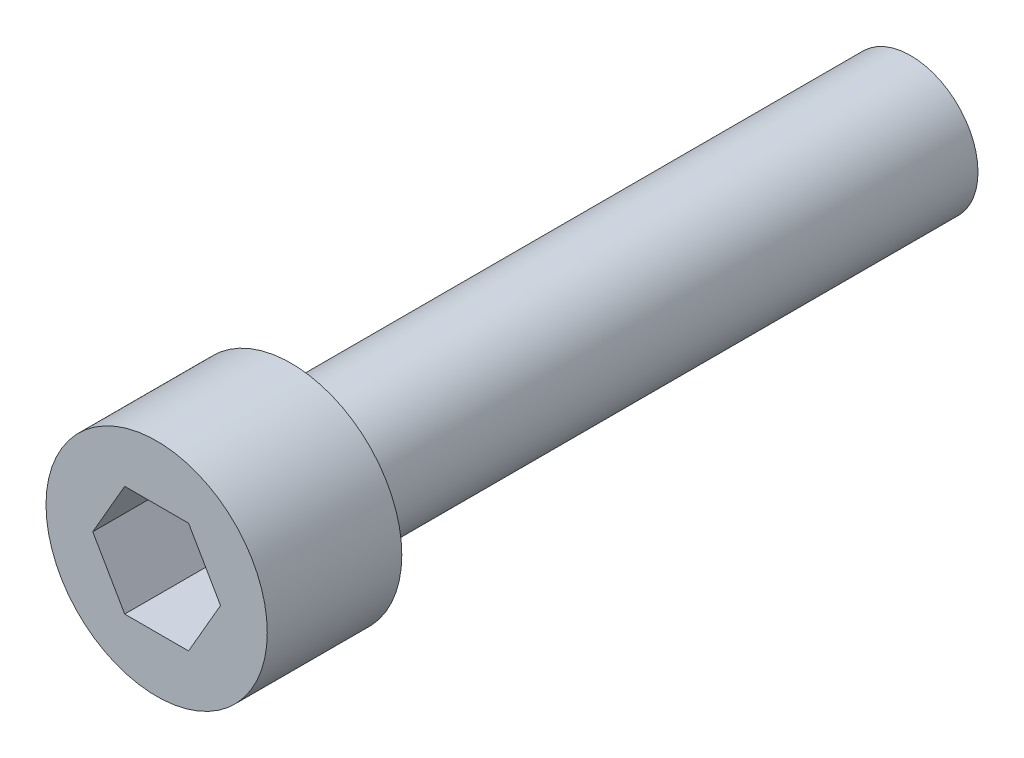
ISO-10303-21;
HEADER;
FILE_DESCRIPTION(('STEP AP214'),'2;1');
FILE_NAME('part.step','',(''),(''),'','','');
FILE_SCHEMA(('AUTOMOTIVE_DESIGN { 1 0 10303 214 1 1 1 1 }'));
ENDSEC;
DATA;
#1=APPLICATION_CONTEXT('core data for automotive mechanical design processes');
#2=APPLICATION_PROTOCOL_DEFINITION('international standard','automotive_design',2000,#1);
#3=PRODUCT_CONTEXT('',#1,'mechanical');
#4=PRODUCT('Part','Part','',(#3));
#5=PRODUCT_RELATED_PRODUCT_CATEGORY('part','',(#4));
#6=PRODUCT_DEFINITION_FORMATION('','',#4);
#7=PRODUCT_DEFINITION_CONTEXT('part definition',#1,'design');
#8=PRODUCT_DEFINITION('design','',#6,#7);
#9=PRODUCT_DEFINITION_SHAPE('','',#8);
#10=(LENGTH_UNIT() NAMED_UNIT(*) SI_UNIT(.MILLI.,.METRE.));
#11=(NAMED_UNIT(*) PLANE_ANGLE_UNIT() SI_UNIT($,.RADIAN.));
#12=(NAMED_UNIT(*) SI_UNIT($,.STERADIAN.) SOLID_ANGLE_UNIT());
#13=UNCERTAINTY_MEASURE_WITH_UNIT(LENGTH_MEASURE(1.E-05),#10,'distance_accuracy_value','');
#14=(GEOMETRIC_REPRESENTATION_CONTEXT(3) GLOBAL_UNCERTAINTY_ASSIGNED_CONTEXT((#13)) GLOBAL_UNIT_ASSIGNED_CONTEXT((#10,
#11,#12)) REPRESENTATION_CONTEXT('',''));
#15=CARTESIAN_POINT('',(0.,0.,0.));
#16=DIRECTION('',(0.,0.,1.));
#17=DIRECTION('',(1.,0.,0.));
#18=AXIS2_PLACEMENT_3D('',#15,#16,#17);
#19=CARTESIAN_POINT('',(0.,0.,22.225));
#20=DIRECTION('',(0.,0.,-1.));
#21=DIRECTION('',(-1.,0.,0.));
#22=AXIS2_PLACEMENT_3D('',#19,#20,#21);
#23=CYLINDRICAL_SURFACE('',#22,2.413);
#24=CARTESIAN_POINT('',(0.,0.,22.225));
#25=DIRECTION('',(0.,0.,1.));
#26=DIRECTION('',(1.,0.,0.));
#27=AXIS2_PLACEMENT_3D('',#24,#25,#26);
#28=CIRCLE('',#27,2.413);
#29=CARTESIAN_POINT('',(2.413,0.,22.225));
#30=VERTEX_POINT('',#29);
#31=EDGE_CURVE('E11',#30,#30,#28,.T.);
#32=ORIENTED_EDGE('',*,*,#31,.F.);
#33=EDGE_LOOP('',(#32));
#34=FACE_BOUND('',#33,.T.);
#35=CARTESIAN_POINT('',(0.,0.,0.));
#36=DIRECTION('',(0.,0.,1.));
#37=DIRECTION('',(1.,0.,0.));
#38=AXIS2_PLACEMENT_3D('',#35,#36,#37);
#39=CIRCLE('',#38,2.413);
#40=CARTESIAN_POINT('',(2.413,0.,0.));
#41=VERTEX_POINT('',#40);
#42=EDGE_CURVE('E36',#41,#41,#39,.T.);
#43=ORIENTED_EDGE('',*,*,#42,.T.);
#44=EDGE_LOOP('',(#43));
#45=FACE_BOUND('',#44,.T.);
#46=ADVANCED_FACE('F33',(#34,#45),#23,.T.);
#47=CARTESIAN_POINT('',(0.,0.,0.));
#48=DIRECTION('',(0.,0.,1.));
#49=DIRECTION('',(1.,0.,0.));
#50=AXIS2_PLACEMENT_3D('',#47,#48,#49);
#51=PLANE('',#50);
#52=ORIENTED_EDGE('',*,*,#42,.F.);
#53=EDGE_LOOP('',(#52));
#54=FACE_BOUND('',#53,.T.);
#55=ADVANCED_FACE('F151',(#54),#51,.F.);
#56=CARTESIAN_POINT('',(0.,0.,22.225));
#57=DIRECTION('',(0.,0.,1.));
#58=DIRECTION('',(1.,0.,0.));
#59=AXIS2_PLACEMENT_3D('',#56,#57,#58);
#60=PLANE('',#59);
#61=CARTESIAN_POINT('',(0.,0.,22.225));
#62=DIRECTION('',(0.,0.,1.));
#63=DIRECTION('',(1.,0.,0.));
#64=AXIS2_PLACEMENT_3D('',#61,#62,#63);
#65=CIRCLE('',#64,3.96875);
#66=CARTESIAN_POINT('',(3.96875,0.,22.225));
#67=VERTEX_POINT('',#66);
#68=EDGE_CURVE('E134',#67,#67,#65,.T.);
#69=ORIENTED_EDGE('',*,*,#68,.F.);
#70=EDGE_LOOP('',(#69));
#71=FACE_BOUND('',#70,.T.);
#72=ORIENTED_EDGE('',*,*,#31,.T.);
#73=EDGE_LOOP('',(#72));
#74=FACE_BOUND('',#73,.T.);
#75=ADVANCED_FACE('F148',(#71,#74),#60,.F.);
#76=CARTESIAN_POINT('',(0.,0.,27.051));
#77=DIRECTION('',(0.,0.,-1.));
#78=DIRECTION('',(-1.,0.,0.));
#79=AXIS2_PLACEMENT_3D('',#76,#77,#78);
#80=CYLINDRICAL_SURFACE('',#79,3.96875);
#81=CARTESIAN_POINT('',(0.,0.,27.051));
#82=DIRECTION('',(0.,0.,1.));
#83=DIRECTION('',(1.,0.,0.));
#84=AXIS2_PLACEMENT_3D('',#81,#82,#83);
#85=CIRCLE('',#84,3.96875);
#86=CARTESIAN_POINT('',(3.96875,0.,27.051));
#87=VERTEX_POINT('',#86);
#88=EDGE_CURVE('E140',#87,#87,#85,.T.);
#89=ORIENTED_EDGE('',*,*,#88,.F.);
#90=EDGE_LOOP('',(#89));
#91=FACE_BOUND('',#90,.T.);
#92=ORIENTED_EDGE('',*,*,#68,.T.);
#93=EDGE_LOOP('',(#92));
#94=FACE_BOUND('',#93,.T.);
#95=ADVANCED_FACE('F146',(#91,#94),#80,.T.);
#96=CARTESIAN_POINT('',(0.,0.,27.051));
#97=DIRECTION('',(0.,0.,1.));
#98=DIRECTION('',(1.,0.,0.));
#99=AXIS2_PLACEMENT_3D('',#96,#97,#98);
#100=PLANE('',#99);
#101=DIRECTION('',(0.5,0.866025403784439,0.));
#102=VECTOR('',#101,1.);
#103=CARTESIAN_POINT('',(1.14567944042316,-1.984375,27.051));
#104=LINE('',#103,#102);
#105=CARTESIAN_POINT('',(1.14567944042316,-1.984375,27.051));
#106=VERTEX_POINT('',#105);
#107=CARTESIAN_POINT('',(2.29135888084633,0.,27.051));
#108=VERTEX_POINT('',#107);
#109=EDGE_CURVE('E47',#106,#108,#104,.T.);
#110=ORIENTED_EDGE('',*,*,#109,.F.);
#111=DIRECTION('',(1.,0.,0.));
#112=VECTOR('',#111,1.);
#113=CARTESIAN_POINT('',(-1.14567944042316,-1.984375,27.051));
#114=LINE('',#113,#112);
#115=CARTESIAN_POINT('',(-1.14567944042316,-1.984375,27.051));
#116=VERTEX_POINT('',#115);
#117=EDGE_CURVE('E130',#116,#106,#114,.T.);
#118=ORIENTED_EDGE('',*,*,#117,.F.);
#119=DIRECTION('',(0.5,-0.866025403784439,0.));
#120=VECTOR('',#119,1.);
#121=CARTESIAN_POINT('',(-2.29135888084633,0.,27.051));
#122=LINE('',#121,#120);
#123=CARTESIAN_POINT('',(-2.29135888084633,0.,27.051));
#124=VERTEX_POINT('',#123);
#125=EDGE_CURVE('E128',#124,#116,#122,.T.);
#126=ORIENTED_EDGE('',*,*,#125,.F.);
#127=DIRECTION('',(-0.5,-0.866025403784439,0.));
#128=VECTOR('',#127,1.);
#129=CARTESIAN_POINT('',(-1.14567944042316,1.984375,27.051));
#130=LINE('',#129,#128);
#131=CARTESIAN_POINT('',(-1.14567944042316,1.984375,27.051));
#132=VERTEX_POINT('',#131);
#133=EDGE_CURVE('E95',#132,#124,#130,.T.);
#134=ORIENTED_EDGE('',*,*,#133,.F.);
#135=DIRECTION('',(-1.,0.,0.));
#136=VECTOR('',#135,1.);
#137=CARTESIAN_POINT('',(1.14567944042316,1.984375,27.051));
#138=LINE('',#137,#136);
#139=CARTESIAN_POINT('',(1.14567944042316,1.984375,27.051));
#140=VERTEX_POINT('',#139);
#141=EDGE_CURVE('E124',#140,#132,#138,.T.);
#142=ORIENTED_EDGE('',*,*,#141,.F.);
#143=DIRECTION('',(-0.5,0.866025403784438,0.));
#144=VECTOR('',#143,1.);
#145=CARTESIAN_POINT('',(2.29135888084633,0.,27.051));
#146=LINE('',#145,#144);
#147=EDGE_CURVE('E121',#108,#140,#146,.T.);
#148=ORIENTED_EDGE('',*,*,#147,.F.);
#149=EDGE_LOOP('',(#110,#118,#126,#134,#142,#148));
#150=FACE_BOUND('',#149,.T.);
#151=ORIENTED_EDGE('',*,*,#88,.T.);
#152=EDGE_LOOP('',(#151));
#153=FACE_BOUND('',#152,.T.);
#154=ADVANCED_FACE('F165',(#150,#153),#100,.T.);
#155=CARTESIAN_POINT('',(1.14567944042316,-1.984375,23.241));
#156=DIRECTION('',(0.866025403784439,-0.5,0.));
#157=DIRECTION('',(0.5,0.866025403784439,0.));
#158=AXIS2_PLACEMENT_3D('',#155,#156,#157);
#159=PLANE('',#158);
#160=ORIENTED_EDGE('',*,*,#109,.T.);
#161=DIRECTION('',(0.,0.,1.));
#162=VECTOR('',#161,1.);
#163=CARTESIAN_POINT('',(2.29135888084633,0.,23.241));
#164=LINE('',#163,#162);
#165=CARTESIAN_POINT('',(2.29135888084633,0.,23.241));
#166=VERTEX_POINT('',#165);
#167=EDGE_CURVE('E77',#166,#108,#164,.T.);
#168=ORIENTED_EDGE('',*,*,#167,.F.);
#169=DIRECTION('',(0.5,0.866025403784439,0.));
#170=VECTOR('',#169,1.);
#171=CARTESIAN_POINT('',(1.14567944042316,-1.984375,23.241));
#172=LINE('',#171,#170);
#173=CARTESIAN_POINT('',(1.14567944042316,-1.984375,23.241));
#174=VERTEX_POINT('',#173);
#175=EDGE_CURVE('E132',#174,#166,#172,.T.);
#176=ORIENTED_EDGE('',*,*,#175,.F.);
#177=DIRECTION('',(0.,0.,1.));
#178=VECTOR('',#177,1.);
#179=CARTESIAN_POINT('',(1.14567944042316,-1.984375,23.241));
#180=LINE('',#179,#178);
#181=EDGE_CURVE('E55',#174,#106,#180,.T.);
#182=ORIENTED_EDGE('',*,*,#181,.T.);
#183=EDGE_LOOP('',(#160,#168,#176,#182));
#184=FACE_BOUND('',#183,.T.);
#185=ADVANCED_FACE('F170',(#184),#159,.F.);
#186=CARTESIAN_POINT('',(-1.14567944042316,-1.984375,23.241));
#187=DIRECTION('',(0.,-1.,0.));
#188=DIRECTION('',(0.,0.,-1.));
#189=AXIS2_PLACEMENT_3D('',#186,#187,#188);
#190=PLANE('',#189);
#191=ORIENTED_EDGE('',*,*,#117,.T.);
#192=ORIENTED_EDGE('',*,*,#181,.F.);
#193=DIRECTION('',(1.,0.,0.));
#194=VECTOR('',#193,1.);
#195=CARTESIAN_POINT('',(-1.14567944042316,-1.984375,23.241));
#196=LINE('',#195,#194);
#197=CARTESIAN_POINT('',(-1.14567944042316,-1.984375,23.241));
#198=VERTEX_POINT('',#197);
#199=EDGE_CURVE('E107',#198,#174,#196,.T.);
#200=ORIENTED_EDGE('',*,*,#199,.F.);
#201=DIRECTION('',(0.,0.,1.));
#202=VECTOR('',#201,1.);
#203=CARTESIAN_POINT('',(-1.14567944042316,-1.984375,23.241));
#204=LINE('',#203,#202);
#205=EDGE_CURVE('E99',#198,#116,#204,.T.);
#206=ORIENTED_EDGE('',*,*,#205,.T.);
#207=EDGE_LOOP('',(#191,#192,#200,#206));
#208=FACE_BOUND('',#207,.T.);
#209=ADVANCED_FACE('F174',(#208),#190,.F.);
#210=CARTESIAN_POINT('',(-2.29135888084633,0.,23.241));
#211=DIRECTION('',(-0.866025403784439,-0.5,0.));
#212=DIRECTION('',(0.5,-0.866025403784439,0.));
#213=AXIS2_PLACEMENT_3D('',#210,#211,#212);
#214=PLANE('',#213);
#215=ORIENTED_EDGE('',*,*,#125,.T.);
#216=ORIENTED_EDGE('',*,*,#205,.F.);
#217=DIRECTION('',(0.5,-0.866025403784439,0.));
#218=VECTOR('',#217,1.);
#219=CARTESIAN_POINT('',(-2.29135888084633,0.,23.241));
#220=LINE('',#219,#218);
#221=CARTESIAN_POINT('',(-2.29135888084633,0.,23.241));
#222=VERTEX_POINT('',#221);
#223=EDGE_CURVE('E103',#222,#198,#220,.T.);
#224=ORIENTED_EDGE('',*,*,#223,.F.);
#225=DIRECTION('',(0.,0.,1.));
#226=VECTOR('',#225,1.);
#227=CARTESIAN_POINT('',(-2.29135888084633,0.,23.241));
#228=LINE('',#227,#226);
#229=EDGE_CURVE('E88',#222,#124,#228,.T.);
#230=ORIENTED_EDGE('',*,*,#229,.T.);
#231=EDGE_LOOP('',(#215,#216,#224,#230));
#232=FACE_BOUND('',#231,.T.);
#233=ADVANCED_FACE('F104',(#232),#214,.F.);
#234=CARTESIAN_POINT('',(-1.14567944042316,1.984375,23.241));
#235=DIRECTION('',(-0.866025403784439,0.5,0.));
#236=DIRECTION('',(-0.5,-0.866025403784439,0.));
#237=AXIS2_PLACEMENT_3D('',#234,#235,#236);
#238=PLANE('',#237);
#239=ORIENTED_EDGE('',*,*,#133,.T.);
#240=ORIENTED_EDGE('',*,*,#229,.F.);
#241=DIRECTION('',(-0.5,-0.866025403784439,0.));
#242=VECTOR('',#241,1.);
#243=CARTESIAN_POINT('',(-1.14567944042316,1.984375,23.241));
#244=LINE('',#243,#242);
#245=CARTESIAN_POINT('',(-1.14567944042316,1.984375,23.241));
#246=VERTEX_POINT('',#245);
#247=EDGE_CURVE('E92',#246,#222,#244,.T.);
#248=ORIENTED_EDGE('',*,*,#247,.F.);
#249=DIRECTION('',(0.,0.,1.));
#250=VECTOR('',#249,1.);
#251=CARTESIAN_POINT('',(-1.14567944042316,1.984375,23.241));
#252=LINE('',#251,#250);
#253=EDGE_CURVE('E100',#246,#132,#252,.T.);
#254=ORIENTED_EDGE('',*,*,#253,.T.);
#255=EDGE_LOOP('',(#239,#240,#248,#254));
#256=FACE_BOUND('',#255,.T.);
#257=ADVANCED_FACE('F90',(#256),#238,.F.);
#258=CARTESIAN_POINT('',(1.14567944042316,1.984375,23.241));
#259=DIRECTION('',(0.,1.,0.));
#260=DIRECTION('',(0.,0.,1.));
#261=AXIS2_PLACEMENT_3D('',#258,#259,#260);
#262=PLANE('',#261);
#263=ORIENTED_EDGE('',*,*,#141,.T.);
#264=ORIENTED_EDGE('',*,*,#253,.F.);
#265=DIRECTION('',(-1.,0.,0.));
#266=VECTOR('',#265,1.);
#267=CARTESIAN_POINT('',(1.14567944042316,1.984375,23.241));
#268=LINE('',#267,#266);
#269=CARTESIAN_POINT('',(1.14567944042316,1.984375,23.241));
#270=VERTEX_POINT('',#269);
#271=EDGE_CURVE('E113',#270,#246,#268,.T.);
#272=ORIENTED_EDGE('',*,*,#271,.F.);
#273=DIRECTION('',(0.,0.,1.));
#274=VECTOR('',#273,1.);
#275=CARTESIAN_POINT('',(1.14567944042316,1.984375,23.241));
#276=LINE('',#275,#274);
#277=EDGE_CURVE('E137',#270,#140,#276,.T.);
#278=ORIENTED_EDGE('',*,*,#277,.T.);
#279=EDGE_LOOP('',(#263,#264,#272,#278));
#280=FACE_BOUND('',#279,.T.);
#281=ADVANCED_FACE('F178',(#280),#262,.F.);
#282=CARTESIAN_POINT('',(2.29135888084633,0.,23.241));
#283=DIRECTION('',(0.866025403784438,0.5,0.));
#284=DIRECTION('',(-0.5,0.866025403784439,0.));
#285=AXIS2_PLACEMENT_3D('',#282,#283,#284);
#286=PLANE('',#285);
#287=ORIENTED_EDGE('',*,*,#147,.T.);
#288=ORIENTED_EDGE('',*,*,#277,.F.);
#289=DIRECTION('',(-0.5,0.866025403784438,0.));
#290=VECTOR('',#289,1.);
#291=CARTESIAN_POINT('',(2.29135888084633,0.,23.241));
#292=LINE('',#291,#290);
#293=EDGE_CURVE('E115',#166,#270,#292,.T.);
#294=ORIENTED_EDGE('',*,*,#293,.F.);
#295=ORIENTED_EDGE('',*,*,#167,.T.);
#296=EDGE_LOOP('',(#287,#288,#294,#295));
#297=FACE_BOUND('',#296,.T.);
#298=ADVANCED_FACE('F175',(#297),#286,.F.);
#299=CARTESIAN_POINT('',(0.,0.,23.241));
#300=DIRECTION('',(0.,0.,1.));
#301=DIRECTION('',(1.,0.,0.));
#302=AXIS2_PLACEMENT_3D('',#299,#300,#301);
#303=PLANE('',#302);
#304=ORIENTED_EDGE('',*,*,#175,.T.);
#305=ORIENTED_EDGE('',*,*,#293,.T.);
#306=ORIENTED_EDGE('',*,*,#271,.T.);
#307=ORIENTED_EDGE('',*,*,#247,.T.);
#308=ORIENTED_EDGE('',*,*,#223,.T.);
#309=ORIENTED_EDGE('',*,*,#199,.T.);
#310=EDGE_LOOP('',(#304,#305,#306,#307,#308,#309));
#311=FACE_BOUND('',#310,.T.);
#312=ADVANCED_FACE('F110',(#311),#303,.T.);
#313=CLOSED_SHELL('',(#46,#55,#75,#95,#154,#185,#209,#233,#257,#281,#298,#312));
#314=MANIFOLD_SOLID_BREP('B2',#313);
#315=ADVANCED_BREP_SHAPE_REPRESENTATION('',(#18,#314),#14);
#316=SHAPE_DEFINITION_REPRESENTATION(#9,#315);
ENDSEC;
END-ISO-10303-21;
